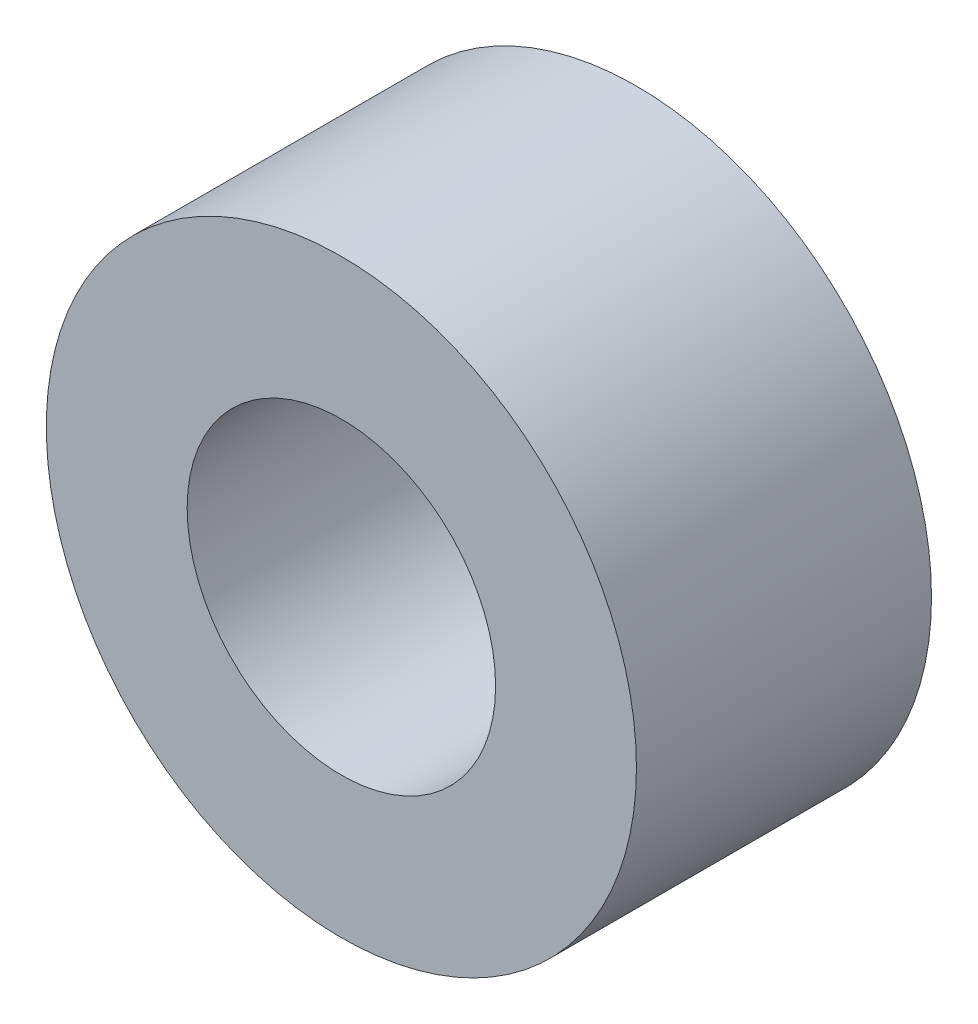
ISO-10303-21;
HEADER;
FILE_DESCRIPTION(('STEP AP214'),'2;1');
FILE_NAME('part.step','',(''),(''),'','','');
FILE_SCHEMA(('AUTOMOTIVE_DESIGN { 1 0 10303 214 1 1 1 1 }'));
ENDSEC;
DATA;
#1=APPLICATION_CONTEXT('core data for automotive mechanical design processes');
#2=APPLICATION_PROTOCOL_DEFINITION('international standard','automotive_design',2000,#1);
#3=PRODUCT_CONTEXT('',#1,'mechanical');
#4=PRODUCT('Part','Part','',(#3));
#5=PRODUCT_RELATED_PRODUCT_CATEGORY('part','',(#4));
#6=PRODUCT_DEFINITION_FORMATION('','',#4);
#7=PRODUCT_DEFINITION_CONTEXT('part definition',#1,'design');
#8=PRODUCT_DEFINITION('design','',#6,#7);
#9=PRODUCT_DEFINITION_SHAPE('','',#8);
#10=(LENGTH_UNIT() NAMED_UNIT(*) SI_UNIT(.MILLI.,.METRE.));
#11=(NAMED_UNIT(*) PLANE_ANGLE_UNIT() SI_UNIT($,.RADIAN.));
#12=(NAMED_UNIT(*) SI_UNIT($,.STERADIAN.) SOLID_ANGLE_UNIT());
#13=UNCERTAINTY_MEASURE_WITH_UNIT(LENGTH_MEASURE(1.E-05),#10,'distance_accuracy_value','');
#14=(GEOMETRIC_REPRESENTATION_CONTEXT(3) GLOBAL_UNCERTAINTY_ASSIGNED_CONTEXT((#13)) GLOBAL_UNIT_ASSIGNED_CONTEXT((#10,
#11,#12)) REPRESENTATION_CONTEXT('',''));
#15=CARTESIAN_POINT('',(0.,0.,0.));
#16=DIRECTION('',(0.,0.,1.));
#17=DIRECTION('',(1.,0.,0.));
#18=AXIS2_PLACEMENT_3D('',#15,#16,#17);
#19=CARTESIAN_POINT('',(0.,0.,4.7625));
#20=DIRECTION('',(0.,0.,1.));
#21=DIRECTION('',(1.,0.,0.));
#22=AXIS2_PLACEMENT_3D('',#19,#20,#21);
#23=PLANE('',#22);
#24=CARTESIAN_POINT('',(0.,0.,4.7625));
#25=DIRECTION('',(0.,0.,1.));
#26=DIRECTION('',(1.,0.,0.));
#27=AXIS2_PLACEMENT_3D('',#24,#25,#26);
#28=CIRCLE('',#27,4.7625);
#29=CARTESIAN_POINT('',(4.7625,0.,4.7625));
#30=VERTEX_POINT('',#29);
#31=EDGE_CURVE('E10',#30,#30,#28,.T.);
#32=ORIENTED_EDGE('',*,*,#31,.T.);
#33=EDGE_LOOP('',(#32));
#34=FACE_BOUND('',#33,.T.);
#35=CARTESIAN_POINT('',(0.,0.,4.7625));
#36=DIRECTION('',(0.,0.,1.));
#37=DIRECTION('',(1.,0.,0.));
#38=AXIS2_PLACEMENT_3D('',#35,#36,#37);
#39=CIRCLE('',#38,2.4892);
#40=CARTESIAN_POINT('',(2.4892,0.,4.7625));
#41=VERTEX_POINT('',#40);
#42=EDGE_CURVE('E50',#41,#41,#39,.T.);
#43=ORIENTED_EDGE('',*,*,#42,.F.);
#44=EDGE_LOOP('',(#43));
#45=FACE_BOUND('',#44,.T.);
#46=ADVANCED_FACE('F37',(#34,#45),#23,.T.);
#47=CARTESIAN_POINT('',(0.,0.,0.));
#48=DIRECTION('',(0.,0.,1.));
#49=DIRECTION('',(1.,0.,0.));
#50=AXIS2_PLACEMENT_3D('',#47,#48,#49);
#51=PLANE('',#50);
#52=CARTESIAN_POINT('',(0.,0.,0.));
#53=DIRECTION('',(0.,0.,1.));
#54=DIRECTION('',(1.,0.,0.));
#55=AXIS2_PLACEMENT_3D('',#52,#53,#54);
#56=CIRCLE('',#55,4.7625);
#57=CARTESIAN_POINT('',(4.7625,0.,0.));
#58=VERTEX_POINT('',#57);
#59=EDGE_CURVE('E41',#58,#58,#56,.T.);
#60=ORIENTED_EDGE('',*,*,#59,.F.);
#61=EDGE_LOOP('',(#60));
#62=FACE_BOUND('',#61,.T.);
#63=CARTESIAN_POINT('',(0.,0.,0.));
#64=DIRECTION('',(0.,0.,1.));
#65=DIRECTION('',(1.,0.,0.));
#66=AXIS2_PLACEMENT_3D('',#63,#64,#65);
#67=CIRCLE('',#66,2.4892);
#68=CARTESIAN_POINT('',(2.4892,0.,0.));
#69=VERTEX_POINT('',#68);
#70=EDGE_CURVE('E52',#69,#69,#67,.T.);
#71=ORIENTED_EDGE('',*,*,#70,.T.);
#72=EDGE_LOOP('',(#71));
#73=FACE_BOUND('',#72,.T.);
#74=ADVANCED_FACE('F64',(#62,#73),#51,.F.);
#75=CARTESIAN_POINT('',(0.,0.,4.7625));
#76=DIRECTION('',(0.,0.,-1.));
#77=DIRECTION('',(-1.,0.,0.));
#78=AXIS2_PLACEMENT_3D('',#75,#76,#77);
#79=CYLINDRICAL_SURFACE('',#78,4.7625);
#80=ORIENTED_EDGE('',*,*,#31,.F.);
#81=EDGE_LOOP('',(#80));
#82=FACE_BOUND('',#81,.T.);
#83=ORIENTED_EDGE('',*,*,#59,.T.);
#84=EDGE_LOOP('',(#83));
#85=FACE_BOUND('',#84,.T.);
#86=ADVANCED_FACE('F39',(#82,#85),#79,.T.);
#87=CARTESIAN_POINT('',(0.,0.,4.7625));
#88=DIRECTION('',(0.,0.,-1.));
#89=DIRECTION('',(-1.,0.,0.));
#90=AXIS2_PLACEMENT_3D('',#87,#88,#89);
#91=CYLINDRICAL_SURFACE('',#90,2.4892);
#92=ORIENTED_EDGE('',*,*,#42,.T.);
#93=EDGE_LOOP('',(#92));
#94=FACE_BOUND('',#93,.T.);
#95=ORIENTED_EDGE('',*,*,#70,.F.);
#96=EDGE_LOOP('',(#95));
#97=FACE_BOUND('',#96,.T.);
#98=ADVANCED_FACE('F60',(#94,#97),#91,.F.);
#99=CLOSED_SHELL('',(#46,#74,#86,#98));
#100=MANIFOLD_SOLID_BREP('B2',#99);
#101=ADVANCED_BREP_SHAPE_REPRESENTATION('',(#18,#100),#14);
#102=SHAPE_DEFINITION_REPRESENTATION(#9,#101);
ENDSEC;
END-ISO-10303-21;
